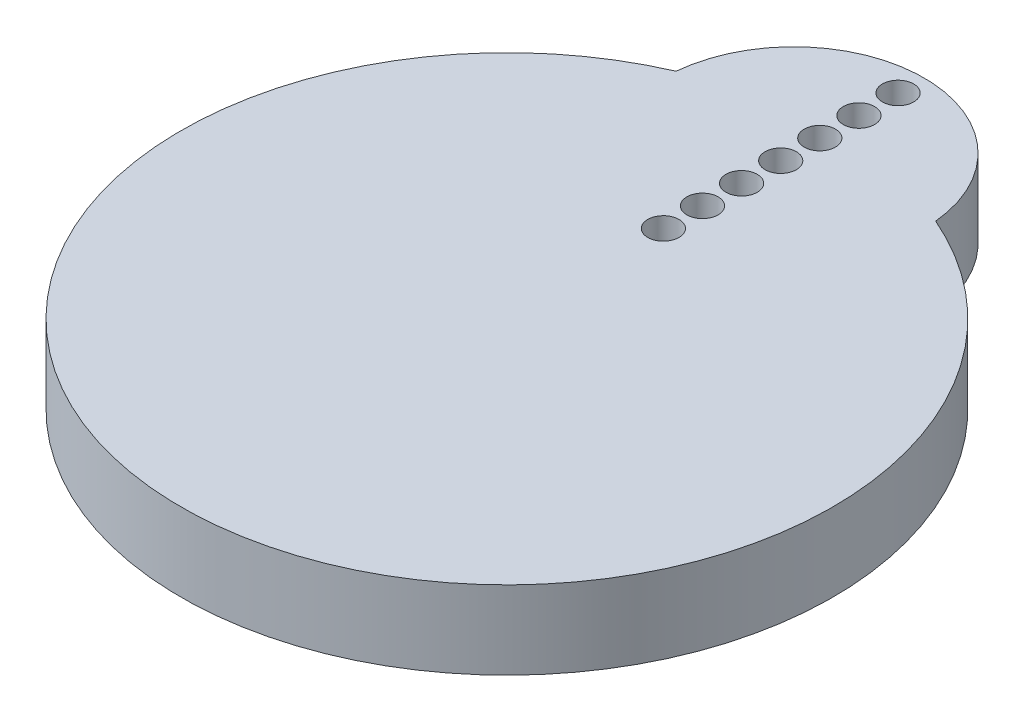
ISO-10303-21;
HEADER;
FILE_DESCRIPTION(('STEP AP214'),'2;1');
FILE_NAME('part.step','',(''),(''),'','','');
FILE_SCHEMA(('AUTOMOTIVE_DESIGN { 1 0 10303 214 1 1 1 1 }'));
ENDSEC;
DATA;
#1=APPLICATION_CONTEXT('core data for automotive mechanical design processes');
#2=APPLICATION_PROTOCOL_DEFINITION('international standard','automotive_design',2000,#1);
#3=PRODUCT_CONTEXT('',#1,'mechanical');
#4=PRODUCT('Part','Part','',(#3));
#5=PRODUCT_RELATED_PRODUCT_CATEGORY('part','',(#4));
#6=PRODUCT_DEFINITION_FORMATION('','',#4);
#7=PRODUCT_DEFINITION_CONTEXT('part definition',#1,'design');
#8=PRODUCT_DEFINITION('design','',#6,#7);
#9=PRODUCT_DEFINITION_SHAPE('','',#8);
#10=(LENGTH_UNIT() NAMED_UNIT(*) SI_UNIT(.MILLI.,.METRE.));
#11=(NAMED_UNIT(*) PLANE_ANGLE_UNIT() SI_UNIT($,.RADIAN.));
#12=(NAMED_UNIT(*) SI_UNIT($,.STERADIAN.) SOLID_ANGLE_UNIT());
#13=UNCERTAINTY_MEASURE_WITH_UNIT(LENGTH_MEASURE(1.E-05),#10,'distance_accuracy_value','');
#14=(GEOMETRIC_REPRESENTATION_CONTEXT(3) GLOBAL_UNCERTAINTY_ASSIGNED_CONTEXT((#13)) GLOBAL_UNIT_ASSIGNED_CONTEXT((#10,
#11,#12)) REPRESENTATION_CONTEXT('',''));
#15=CARTESIAN_POINT('',(0.,0.,0.));
#16=DIRECTION('',(0.,0.,1.));
#17=DIRECTION('',(1.,0.,0.));
#18=AXIS2_PLACEMENT_3D('',#15,#16,#17);
#19=CARTESIAN_POINT('',(0.,3.,0.));
#20=DIRECTION('',(0.,-1.,0.));
#21=DIRECTION('',(0.,0.,-1.));
#22=AXIS2_PLACEMENT_3D('',#19,#20,#21);
#23=CYLINDRICAL_SURFACE('',#22,12.5);
#24=CARTESIAN_POINT('',(0.,3.,0.));
#25=DIRECTION('',(0.,1.,0.));
#26=DIRECTION('',(0.,0.,1.));
#27=AXIS2_PLACEMENT_3D('',#24,#25,#26);
#28=CIRCLE('',#27,12.5);
#29=CARTESIAN_POINT('',(-4.97824554627514,3.,-11.4659090909091));
#30=VERTEX_POINT('',#29);
#31=CARTESIAN_POINT('',(4.97824554627514,3.,-11.4659090909091));
#32=VERTEX_POINT('',#31);
#33=EDGE_CURVE('E11',#30,#32,#28,.T.);
#34=ORIENTED_EDGE('',*,*,#33,.F.);
#35=DIRECTION('',(0.,1.,0.));
#36=VECTOR('',#35,1.);
#37=CARTESIAN_POINT('',(-4.97824554627514,-37.9110801745347,-11.4659090909091));
#38=LINE('',#37,#36);
#39=CARTESIAN_POINT('',(-4.97824554627514,0.,-11.4659090909091));
#40=VERTEX_POINT('',#39);
#41=EDGE_CURVE('E71',#40,#30,#38,.T.);
#42=ORIENTED_EDGE('',*,*,#41,.F.);
#43=CARTESIAN_POINT('',(0.,0.,0.));
#44=DIRECTION('',(0.,1.,0.));
#45=DIRECTION('',(0.,0.,1.));
#46=AXIS2_PLACEMENT_3D('',#43,#44,#45);
#47=CIRCLE('',#46,12.5);
#48=CARTESIAN_POINT('',(4.97824554627514,0.,-11.4659090909091));
#49=VERTEX_POINT('',#48);
#50=EDGE_CURVE('E48',#40,#49,#47,.T.);
#51=ORIENTED_EDGE('',*,*,#50,.T.);
#52=DIRECTION('',(0.,1.,0.));
#53=VECTOR('',#52,1.);
#54=CARTESIAN_POINT('',(4.97824554627514,1.5,-11.4659090909091));
#55=LINE('',#54,#53);
#56=EDGE_CURVE('E59',#49,#32,#55,.T.);
#57=ORIENTED_EDGE('',*,*,#56,.T.);
#58=EDGE_LOOP('',(#34,#42,#51,#57));
#59=FACE_BOUND('',#58,.T.);
#60=ADVANCED_FACE('F40',(#59),#23,.T.);
#61=CARTESIAN_POINT('',(0.,3.,0.));
#62=DIRECTION('',(0.,1.,0.));
#63=DIRECTION('',(0.,0.,1.));
#64=AXIS2_PLACEMENT_3D('',#61,#62,#63);
#65=PLANE('',#64);
#66=CARTESIAN_POINT('',(0.,3.,-6.));
#67=DIRECTION('',(0.,1.,0.));
#68=DIRECTION('',(0.,0.,1.));
#69=AXIS2_PLACEMENT_3D('',#66,#67,#68);
#70=CIRCLE('',#69,0.6);
#71=CARTESIAN_POINT('',(0.,3.,-5.4));
#72=VERTEX_POINT('',#71);
#73=EDGE_CURVE('E85',#72,#72,#70,.T.);
#74=ORIENTED_EDGE('',*,*,#73,.F.);
#75=EDGE_LOOP('',(#74));
#76=FACE_BOUND('',#75,.T.);
#77=CARTESIAN_POINT('',(0.,3.,-7.5));
#78=DIRECTION('',(0.,1.,0.));
#79=DIRECTION('',(0.,0.,1.));
#80=AXIS2_PLACEMENT_3D('',#77,#78,#79);
#81=CIRCLE('',#80,0.6);
#82=CARTESIAN_POINT('',(0.,3.,-6.9));
#83=VERTEX_POINT('',#82);
#84=EDGE_CURVE('E120',#83,#83,#81,.T.);
#85=ORIENTED_EDGE('',*,*,#84,.F.);
#86=EDGE_LOOP('',(#85));
#87=FACE_BOUND('',#86,.T.);
#88=CARTESIAN_POINT('',(0.,3.,-9.));
#89=DIRECTION('',(0.,1.,0.));
#90=DIRECTION('',(0.,0.,1.));
#91=AXIS2_PLACEMENT_3D('',#88,#89,#90);
#92=CIRCLE('',#91,0.6);
#93=CARTESIAN_POINT('',(0.,3.,-8.4));
#94=VERTEX_POINT('',#93);
#95=EDGE_CURVE('E117',#94,#94,#92,.T.);
#96=ORIENTED_EDGE('',*,*,#95,.F.);
#97=EDGE_LOOP('',(#96));
#98=FACE_BOUND('',#97,.T.);
#99=CARTESIAN_POINT('',(0.,3.,-10.5));
#100=DIRECTION('',(0.,1.,0.));
#101=DIRECTION('',(0.,0.,1.));
#102=AXIS2_PLACEMENT_3D('',#99,#100,#101);
#103=CIRCLE('',#102,0.6);
#104=CARTESIAN_POINT('',(0.,3.,-9.9));
#105=VERTEX_POINT('',#104);
#106=EDGE_CURVE('E114',#105,#105,#103,.T.);
#107=ORIENTED_EDGE('',*,*,#106,.F.);
#108=EDGE_LOOP('',(#107));
#109=FACE_BOUND('',#108,.T.);
#110=CARTESIAN_POINT('',(0.,3.,-12.));
#111=DIRECTION('',(0.,1.,0.));
#112=DIRECTION('',(0.,0.,1.));
#113=AXIS2_PLACEMENT_3D('',#110,#111,#112);
#114=CIRCLE('',#113,0.6);
#115=CARTESIAN_POINT('',(0.,3.,-11.4));
#116=VERTEX_POINT('',#115);
#117=EDGE_CURVE('E111',#116,#116,#114,.T.);
#118=ORIENTED_EDGE('',*,*,#117,.F.);
#119=EDGE_LOOP('',(#118));
#120=FACE_BOUND('',#119,.T.);
#121=CARTESIAN_POINT('',(0.,3.,-13.5));
#122=DIRECTION('',(0.,1.,0.));
#123=DIRECTION('',(0.,0.,1.));
#124=AXIS2_PLACEMENT_3D('',#121,#122,#123);
#125=CIRCLE('',#124,0.6);
#126=CARTESIAN_POINT('',(0.,3.,-12.9));
#127=VERTEX_POINT('',#126);
#128=EDGE_CURVE('E108',#127,#127,#125,.T.);
#129=ORIENTED_EDGE('',*,*,#128,.F.);
#130=EDGE_LOOP('',(#129));
#131=FACE_BOUND('',#130,.T.);
#132=CARTESIAN_POINT('',(0.,3.,-15.));
#133=DIRECTION('',(0.,1.,0.));
#134=DIRECTION('',(0.,0.,1.));
#135=AXIS2_PLACEMENT_3D('',#132,#133,#134);
#136=CIRCLE('',#135,0.6);
#137=CARTESIAN_POINT('',(0.,3.,-14.4));
#138=VERTEX_POINT('',#137);
#139=EDGE_CURVE('E105',#138,#138,#136,.T.);
#140=ORIENTED_EDGE('',*,*,#139,.F.);
#141=EDGE_LOOP('',(#140));
#142=FACE_BOUND('',#141,.T.);
#143=CARTESIAN_POINT('',(0.,3.,-11.));
#144=DIRECTION('',(0.,1.,0.));
#145=DIRECTION('',(0.,0.,1.));
#146=AXIS2_PLACEMENT_3D('',#143,#144,#145);
#147=CIRCLE('',#146,5.);
#148=EDGE_CURVE('E74',#32,#30,#147,.T.);
#149=ORIENTED_EDGE('',*,*,#148,.T.);
#150=ORIENTED_EDGE('',*,*,#33,.T.);
#151=EDGE_LOOP('',(#149,#150));
#152=FACE_BOUND('',#151,.T.);
#153=ADVANCED_FACE('F129',(#76,#87,#98,#109,#120,#131,#142,#152),#65,.T.);
#154=CARTESIAN_POINT('',(0.,0.,0.));
#155=DIRECTION('',(0.,1.,0.));
#156=DIRECTION('',(0.,0.,1.));
#157=AXIS2_PLACEMENT_3D('',#154,#155,#156);
#158=PLANE('',#157);
#159=CARTESIAN_POINT('',(0.,0.,-6.));
#160=DIRECTION('',(0.,1.,0.));
#161=DIRECTION('',(0.,0.,1.));
#162=AXIS2_PLACEMENT_3D('',#159,#160,#161);
#163=CIRCLE('',#162,0.6);
#164=CARTESIAN_POINT('',(0.,0.,-5.4));
#165=VERTEX_POINT('',#164);
#166=EDGE_CURVE('E43',#165,#165,#163,.T.);
#167=ORIENTED_EDGE('',*,*,#166,.T.);
#168=EDGE_LOOP('',(#167));
#169=FACE_BOUND('',#168,.T.);
#170=CARTESIAN_POINT('',(0.,0.,-7.5));
#171=DIRECTION('',(0.,1.,0.));
#172=DIRECTION('',(0.,0.,1.));
#173=AXIS2_PLACEMENT_3D('',#170,#171,#172);
#174=CIRCLE('',#173,0.6);
#175=CARTESIAN_POINT('',(0.,0.,-6.9));
#176=VERTEX_POINT('',#175);
#177=EDGE_CURVE('E96',#176,#176,#174,.T.);
#178=ORIENTED_EDGE('',*,*,#177,.T.);
#179=EDGE_LOOP('',(#178));
#180=FACE_BOUND('',#179,.T.);
#181=CARTESIAN_POINT('',(0.,0.,-9.));
#182=DIRECTION('',(0.,1.,0.));
#183=DIRECTION('',(0.,0.,1.));
#184=AXIS2_PLACEMENT_3D('',#181,#182,#183);
#185=CIRCLE('',#184,0.6);
#186=CARTESIAN_POINT('',(0.,0.,-8.4));
#187=VERTEX_POINT('',#186);
#188=EDGE_CURVE('E94',#187,#187,#185,.T.);
#189=ORIENTED_EDGE('',*,*,#188,.T.);
#190=EDGE_LOOP('',(#189));
#191=FACE_BOUND('',#190,.T.);
#192=CARTESIAN_POINT('',(0.,0.,-10.5));
#193=DIRECTION('',(0.,1.,0.));
#194=DIRECTION('',(0.,0.,1.));
#195=AXIS2_PLACEMENT_3D('',#192,#193,#194);
#196=CIRCLE('',#195,0.6);
#197=CARTESIAN_POINT('',(0.,0.,-9.9));
#198=VERTEX_POINT('',#197);
#199=EDGE_CURVE('E91',#198,#198,#196,.T.);
#200=ORIENTED_EDGE('',*,*,#199,.T.);
#201=EDGE_LOOP('',(#200));
#202=FACE_BOUND('',#201,.T.);
#203=CARTESIAN_POINT('',(0.,0.,-12.));
#204=DIRECTION('',(0.,1.,0.));
#205=DIRECTION('',(0.,0.,1.));
#206=AXIS2_PLACEMENT_3D('',#203,#204,#205);
#207=CIRCLE('',#206,0.6);
#208=CARTESIAN_POINT('',(0.,0.,-11.4));
#209=VERTEX_POINT('',#208);
#210=EDGE_CURVE('E88',#209,#209,#207,.T.);
#211=ORIENTED_EDGE('',*,*,#210,.T.);
#212=EDGE_LOOP('',(#211));
#213=FACE_BOUND('',#212,.T.);
#214=CARTESIAN_POINT('',(0.,0.,-13.5));
#215=DIRECTION('',(0.,1.,0.));
#216=DIRECTION('',(0.,0.,1.));
#217=AXIS2_PLACEMENT_3D('',#214,#215,#216);
#218=CIRCLE('',#217,0.6);
#219=CARTESIAN_POINT('',(0.,0.,-12.9));
#220=VERTEX_POINT('',#219);
#221=EDGE_CURVE('E84',#220,#220,#218,.T.);
#222=ORIENTED_EDGE('',*,*,#221,.T.);
#223=EDGE_LOOP('',(#222));
#224=FACE_BOUND('',#223,.T.);
#225=CARTESIAN_POINT('',(0.,0.,-15.));
#226=DIRECTION('',(0.,1.,0.));
#227=DIRECTION('',(0.,0.,1.));
#228=AXIS2_PLACEMENT_3D('',#225,#226,#227);
#229=CIRCLE('',#228,0.6);
#230=CARTESIAN_POINT('',(0.,0.,-14.4));
#231=VERTEX_POINT('',#230);
#232=EDGE_CURVE('E81',#231,#231,#229,.T.);
#233=ORIENTED_EDGE('',*,*,#232,.T.);
#234=EDGE_LOOP('',(#233));
#235=FACE_BOUND('',#234,.T.);
#236=ORIENTED_EDGE('',*,*,#50,.F.);
#237=CARTESIAN_POINT('',(0.,0.,-11.));
#238=DIRECTION('',(0.,1.,0.));
#239=DIRECTION('',(0.,0.,1.));
#240=AXIS2_PLACEMENT_3D('',#237,#238,#239);
#241=CIRCLE('',#240,5.);
#242=EDGE_CURVE('E68',#40,#49,#241,.F.);
#243=ORIENTED_EDGE('',*,*,#242,.T.);
#244=EDGE_LOOP('',(#236,#243));
#245=FACE_BOUND('',#244,.T.);
#246=ADVANCED_FACE('F66',(#169,#180,#191,#202,#213,#224,#235,#245),#158,.F.);
#247=CARTESIAN_POINT('',(0.,-37.9110801745347,-11.));
#248=DIRECTION('',(0.,1.,0.));
#249=DIRECTION('',(0.,0.,1.));
#250=AXIS2_PLACEMENT_3D('',#247,#248,#249);
#251=CYLINDRICAL_SURFACE('',#250,5.);
#252=ORIENTED_EDGE('',*,*,#56,.F.);
#253=ORIENTED_EDGE('',*,*,#242,.F.);
#254=ORIENTED_EDGE('',*,*,#41,.T.);
#255=ORIENTED_EDGE('',*,*,#148,.F.);
#256=EDGE_LOOP('',(#252,#253,#254,#255));
#257=FACE_BOUND('',#256,.T.);
#258=ADVANCED_FACE('F76',(#257),#251,.T.);
#259=CARTESIAN_POINT('',(0.,-7.,-15.));
#260=DIRECTION('',(0.,1.,0.));
#261=DIRECTION('',(0.,0.,1.));
#262=AXIS2_PLACEMENT_3D('',#259,#260,#261);
#263=CYLINDRICAL_SURFACE('',#262,0.6);
#264=ORIENTED_EDGE('',*,*,#139,.T.);
#265=EDGE_LOOP('',(#264));
#266=FACE_BOUND('',#265,.T.);
#267=ORIENTED_EDGE('',*,*,#232,.F.);
#268=EDGE_LOOP('',(#267));
#269=FACE_BOUND('',#268,.T.);
#270=ADVANCED_FACE('F145',(#266,#269),#263,.F.);
#271=CARTESIAN_POINT('',(0.,-7.,-13.5));
#272=DIRECTION('',(0.,1.,0.));
#273=DIRECTION('',(0.,0.,1.));
#274=AXIS2_PLACEMENT_3D('',#271,#272,#273);
#275=CYLINDRICAL_SURFACE('',#274,0.6);
#276=ORIENTED_EDGE('',*,*,#128,.T.);
#277=EDGE_LOOP('',(#276));
#278=FACE_BOUND('',#277,.T.);
#279=ORIENTED_EDGE('',*,*,#221,.F.);
#280=EDGE_LOOP('',(#279));
#281=FACE_BOUND('',#280,.T.);
#282=ADVANCED_FACE('F148',(#278,#281),#275,.F.);
#283=CARTESIAN_POINT('',(0.,-7.,-12.));
#284=DIRECTION('',(0.,1.,0.));
#285=DIRECTION('',(0.,0.,1.));
#286=AXIS2_PLACEMENT_3D('',#283,#284,#285);
#287=CYLINDRICAL_SURFACE('',#286,0.6);
#288=ORIENTED_EDGE('',*,*,#117,.T.);
#289=EDGE_LOOP('',(#288));
#290=FACE_BOUND('',#289,.T.);
#291=ORIENTED_EDGE('',*,*,#210,.F.);
#292=EDGE_LOOP('',(#291));
#293=FACE_BOUND('',#292,.T.);
#294=ADVANCED_FACE('F188',(#290,#293),#287,.F.);
#295=CARTESIAN_POINT('',(0.,-7.,-10.5));
#296=DIRECTION('',(0.,1.,0.));
#297=DIRECTION('',(0.,0.,1.));
#298=AXIS2_PLACEMENT_3D('',#295,#296,#297);
#299=CYLINDRICAL_SURFACE('',#298,0.6);
#300=ORIENTED_EDGE('',*,*,#106,.T.);
#301=EDGE_LOOP('',(#300));
#302=FACE_BOUND('',#301,.T.);
#303=ORIENTED_EDGE('',*,*,#199,.F.);
#304=EDGE_LOOP('',(#303));
#305=FACE_BOUND('',#304,.T.);
#306=ADVANCED_FACE('F198',(#302,#305),#299,.F.);
#307=CARTESIAN_POINT('',(0.,-7.,-9.));
#308=DIRECTION('',(0.,1.,0.));
#309=DIRECTION('',(0.,0.,1.));
#310=AXIS2_PLACEMENT_3D('',#307,#308,#309);
#311=CYLINDRICAL_SURFACE('',#310,0.6);
#312=ORIENTED_EDGE('',*,*,#95,.T.);
#313=EDGE_LOOP('',(#312));
#314=FACE_BOUND('',#313,.T.);
#315=ORIENTED_EDGE('',*,*,#188,.F.);
#316=EDGE_LOOP('',(#315));
#317=FACE_BOUND('',#316,.T.);
#318=ADVANCED_FACE('F208',(#314,#317),#311,.F.);
#319=CARTESIAN_POINT('',(0.,-7.,-7.5));
#320=DIRECTION('',(0.,1.,0.));
#321=DIRECTION('',(0.,0.,1.));
#322=AXIS2_PLACEMENT_3D('',#319,#320,#321);
#323=CYLINDRICAL_SURFACE('',#322,0.6);
#324=ORIENTED_EDGE('',*,*,#84,.T.);
#325=EDGE_LOOP('',(#324));
#326=FACE_BOUND('',#325,.T.);
#327=ORIENTED_EDGE('',*,*,#177,.F.);
#328=EDGE_LOOP('',(#327));
#329=FACE_BOUND('',#328,.T.);
#330=ADVANCED_FACE('F218',(#326,#329),#323,.F.);
#331=CARTESIAN_POINT('',(0.,-7.,-6.));
#332=DIRECTION('',(0.,1.,0.));
#333=DIRECTION('',(0.,0.,1.));
#334=AXIS2_PLACEMENT_3D('',#331,#332,#333);
#335=CYLINDRICAL_SURFACE('',#334,0.6);
#336=ORIENTED_EDGE('',*,*,#73,.T.);
#337=EDGE_LOOP('',(#336));
#338=FACE_BOUND('',#337,.T.);
#339=ORIENTED_EDGE('',*,*,#166,.F.);
#340=EDGE_LOOP('',(#339));
#341=FACE_BOUND('',#340,.T.);
#342=ADVANCED_FACE('F126',(#338,#341),#335,.F.);
#343=CLOSED_SHELL('',(#60,#153,#246,#258,#270,#282,#294,#306,#318,#330,#342));
#344=MANIFOLD_SOLID_BREP('B2',#343);
#345=ADVANCED_BREP_SHAPE_REPRESENTATION('',(#18,#344),#14);
#346=SHAPE_DEFINITION_REPRESENTATION(#9,#345);
ENDSEC;
END-ISO-10303-21;
